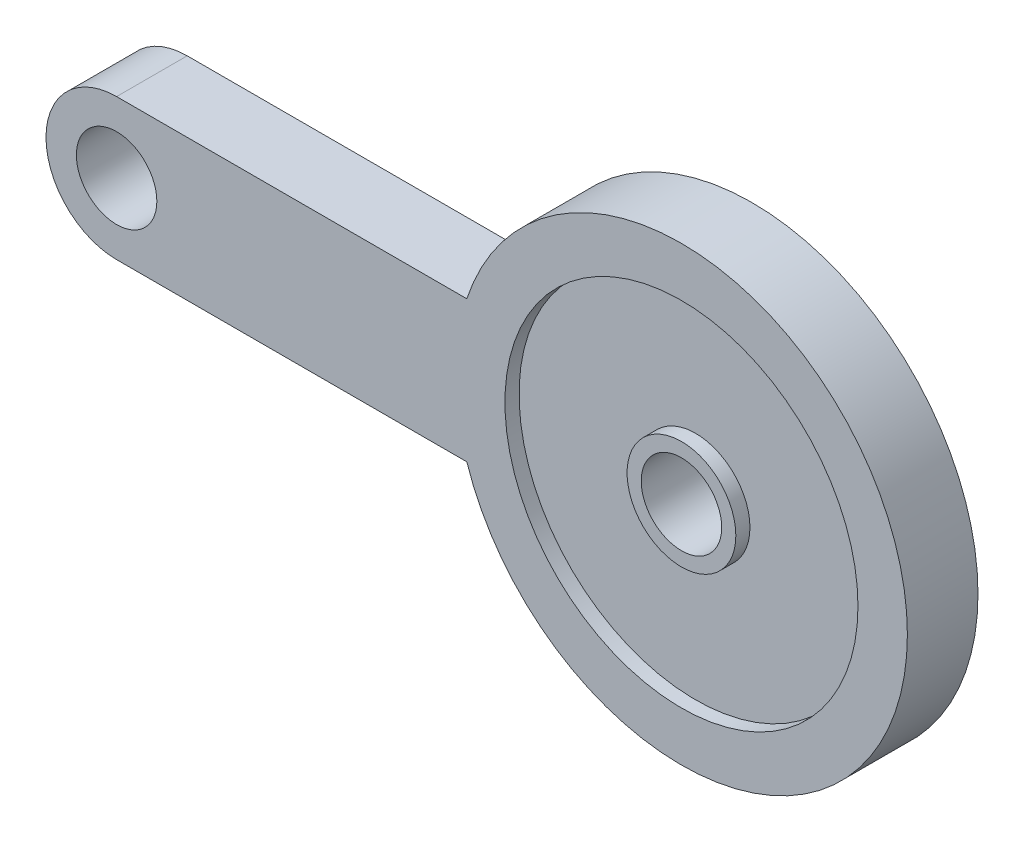
ISO-10303-21;
HEADER;
FILE_DESCRIPTION(('STEP AP214'),'2;1');
FILE_NAME('part.step','',(''),(''),'','','');
FILE_SCHEMA(('AUTOMOTIVE_DESIGN { 1 0 10303 214 1 1 1 1 }'));
ENDSEC;
DATA;
#1=APPLICATION_CONTEXT('core data for automotive mechanical design processes');
#2=APPLICATION_PROTOCOL_DEFINITION('international standard','automotive_design',2000,#1);
#3=PRODUCT_CONTEXT('',#1,'mechanical');
#4=PRODUCT('Part','Part','',(#3));
#5=PRODUCT_RELATED_PRODUCT_CATEGORY('part','',(#4));
#6=PRODUCT_DEFINITION_FORMATION('','',#4);
#7=PRODUCT_DEFINITION_CONTEXT('part definition',#1,'design');
#8=PRODUCT_DEFINITION('design','',#6,#7);
#9=PRODUCT_DEFINITION_SHAPE('','',#8);
#10=(LENGTH_UNIT() NAMED_UNIT(*) SI_UNIT(.MILLI.,.METRE.));
#11=(NAMED_UNIT(*) PLANE_ANGLE_UNIT() SI_UNIT($,.RADIAN.));
#12=(NAMED_UNIT(*) SI_UNIT($,.STERADIAN.) SOLID_ANGLE_UNIT());
#13=UNCERTAINTY_MEASURE_WITH_UNIT(LENGTH_MEASURE(1.E-05),#10,'distance_accuracy_value','');
#14=(GEOMETRIC_REPRESENTATION_CONTEXT(3) GLOBAL_UNCERTAINTY_ASSIGNED_CONTEXT((#13)) GLOBAL_UNIT_ASSIGNED_CONTEXT((#10,
#11,#12)) REPRESENTATION_CONTEXT('',''));
#15=CARTESIAN_POINT('',(0.,0.,0.));
#16=DIRECTION('',(0.,0.,1.));
#17=DIRECTION('',(1.,0.,0.));
#18=AXIS2_PLACEMENT_3D('',#15,#16,#17);
#19=CARTESIAN_POINT('',(20.,0.,1.5));
#20=DIRECTION('',(0.,0.,1.));
#21=DIRECTION('',(1.,0.,0.));
#22=AXIS2_PLACEMENT_3D('',#19,#20,#21);
#23=PLANE('',#22);
#24=CARTESIAN_POINT('',(20.,0.,1.5));
#25=DIRECTION('',(0.,0.,1.));
#26=DIRECTION('',(1.,0.,0.));
#27=AXIS2_PLACEMENT_3D('',#24,#25,#26);
#28=CIRCLE('',#27,12.5);
#29=CARTESIAN_POINT('',(32.5,0.,1.5));
#30=VERTEX_POINT('',#29);
#31=EDGE_CURVE('E85',#30,#30,#28,.T.);
#32=ORIENTED_EDGE('',*,*,#31,.T.);
#33=EDGE_LOOP('',(#32));
#34=FACE_BOUND('',#33,.T.);
#35=CARTESIAN_POINT('',(20.,0.,1.5));
#36=DIRECTION('',(0.,0.,1.));
#37=DIRECTION('',(1.,0.,0.));
#38=AXIS2_PLACEMENT_3D('',#35,#36,#37);
#39=CIRCLE('',#38,3.85);
#40=CARTESIAN_POINT('',(23.85,0.,1.5));
#41=VERTEX_POINT('',#40);
#42=EDGE_CURVE('E130',#41,#41,#39,.F.);
#43=ORIENTED_EDGE('',*,*,#42,.T.);
#44=EDGE_LOOP('',(#43));
#45=FACE_BOUND('',#44,.T.);
#46=ADVANCED_FACE('F39',(#34,#45),#23,.T.);
#47=CARTESIAN_POINT('',(20.,0.,-1.5));
#48=DIRECTION('',(0.,0.,1.));
#49=DIRECTION('',(1.,0.,0.));
#50=AXIS2_PLACEMENT_3D('',#47,#48,#49);
#51=PLANE('',#50);
#52=CARTESIAN_POINT('',(20.,0.,-1.5));
#53=DIRECTION('',(0.,0.,1.));
#54=DIRECTION('',(1.,0.,0.));
#55=AXIS2_PLACEMENT_3D('',#52,#53,#54);
#56=CIRCLE('',#55,12.5);
#57=CARTESIAN_POINT('',(32.5,0.,-1.5));
#58=VERTEX_POINT('',#57);
#59=EDGE_CURVE('E124',#58,#58,#56,.T.);
#60=ORIENTED_EDGE('',*,*,#59,.F.);
#61=EDGE_LOOP('',(#60));
#62=FACE_BOUND('',#61,.T.);
#63=CARTESIAN_POINT('',(20.,0.,-1.5));
#64=DIRECTION('',(0.,0.,1.));
#65=DIRECTION('',(1.,0.,0.));
#66=AXIS2_PLACEMENT_3D('',#63,#64,#65);
#67=CIRCLE('',#66,3.85);
#68=CARTESIAN_POINT('',(23.85,0.,-1.5));
#69=VERTEX_POINT('',#68);
#70=EDGE_CURVE('E11',#69,#69,#67,.F.);
#71=ORIENTED_EDGE('',*,*,#70,.F.);
#72=EDGE_LOOP('',(#71));
#73=FACE_BOUND('',#72,.T.);
#74=ADVANCED_FACE('F159',(#62,#73),#51,.F.);
#75=CARTESIAN_POINT('',(-20.,-5.,2.5));
#76=DIRECTION('',(0.,1.,0.));
#77=DIRECTION('',(-1.,0.,0.));
#78=AXIS2_PLACEMENT_3D('',#75,#76,#77);
#79=PLANE('',#78);
#80=DIRECTION('',(0.,0.,-1.));
#81=VECTOR('',#80,1.);
#82=CARTESIAN_POINT('',(4.80131584642933,-5.,2.5));
#83=LINE('',#82,#81);
#84=CARTESIAN_POINT('',(4.80131584642933,-5.,2.5));
#85=VERTEX_POINT('',#84);
#86=CARTESIAN_POINT('',(4.80131584642933,-5.,-2.5));
#87=VERTEX_POINT('',#86);
#88=EDGE_CURVE('E54',#85,#87,#83,.T.);
#89=ORIENTED_EDGE('',*,*,#88,.F.);
#90=DIRECTION('',(1.,0.,0.));
#91=VECTOR('',#90,1.);
#92=CARTESIAN_POINT('',(-20.,-5.,2.5));
#93=LINE('',#92,#91);
#94=CARTESIAN_POINT('',(-20.,-5.,2.5));
#95=VERTEX_POINT('',#94);
#96=EDGE_CURVE('E110',#95,#85,#93,.T.);
#97=ORIENTED_EDGE('',*,*,#96,.F.);
#98=DIRECTION('',(0.,0.,-1.));
#99=VECTOR('',#98,1.);
#100=CARTESIAN_POINT('',(-20.,-5.,2.5));
#101=LINE('',#100,#99);
#102=CARTESIAN_POINT('',(-20.,-5.,-2.5));
#103=VERTEX_POINT('',#102);
#104=EDGE_CURVE('E101',#95,#103,#101,.T.);
#105=ORIENTED_EDGE('',*,*,#104,.T.);
#106=DIRECTION('',(1.,0.,0.));
#107=VECTOR('',#106,1.);
#108=CARTESIAN_POINT('',(-20.,-5.,-2.5));
#109=LINE('',#108,#107);
#110=EDGE_CURVE('E59',#103,#87,#109,.T.);
#111=ORIENTED_EDGE('',*,*,#110,.T.);
#112=EDGE_LOOP('',(#89,#97,#105,#111));
#113=FACE_BOUND('',#112,.T.);
#114=ADVANCED_FACE('F161',(#113),#79,.F.);
#115=CARTESIAN_POINT('',(-20.,5.,2.5));
#116=DIRECTION('',(0.,-1.,0.));
#117=DIRECTION('',(1.,0.,0.));
#118=AXIS2_PLACEMENT_3D('',#115,#116,#117);
#119=PLANE('',#118);
#120=DIRECTION('',(0.,0.,-1.));
#121=VECTOR('',#120,1.);
#122=CARTESIAN_POINT('',(4.80131584642933,5.,2.5));
#123=LINE('',#122,#121);
#124=CARTESIAN_POINT('',(4.80131584642933,5.,-2.5));
#125=VERTEX_POINT('',#124);
#126=CARTESIAN_POINT('',(4.80131584642933,5.,2.5));
#127=VERTEX_POINT('',#126);
#128=EDGE_CURVE('E47',#125,#127,#123,.F.);
#129=ORIENTED_EDGE('',*,*,#128,.F.);
#130=DIRECTION('',(-1.,0.,0.));
#131=VECTOR('',#130,1.);
#132=CARTESIAN_POINT('',(-20.,5.,-2.5));
#133=LINE('',#132,#131);
#134=CARTESIAN_POINT('',(-20.,5.,-2.5));
#135=VERTEX_POINT('',#134);
#136=EDGE_CURVE('E88',#125,#135,#133,.T.);
#137=ORIENTED_EDGE('',*,*,#136,.T.);
#138=DIRECTION('',(0.,0.,-1.));
#139=VECTOR('',#138,1.);
#140=CARTESIAN_POINT('',(-20.,5.,2.5));
#141=LINE('',#140,#139);
#142=CARTESIAN_POINT('',(-20.,5.,2.5));
#143=VERTEX_POINT('',#142);
#144=EDGE_CURVE('E102',#143,#135,#141,.T.);
#145=ORIENTED_EDGE('',*,*,#144,.F.);
#146=DIRECTION('',(-1.,0.,0.));
#147=VECTOR('',#146,1.);
#148=CARTESIAN_POINT('',(-20.,5.,2.5));
#149=LINE('',#148,#147);
#150=EDGE_CURVE('E100',#127,#143,#149,.T.);
#151=ORIENTED_EDGE('',*,*,#150,.F.);
#152=EDGE_LOOP('',(#129,#137,#145,#151));
#153=FACE_BOUND('',#152,.T.);
#154=ADVANCED_FACE('F99',(#153),#119,.F.);
#155=CARTESIAN_POINT('',(-20.,0.,2.5));
#156=DIRECTION('',(0.,0.,1.));
#157=DIRECTION('',(1.,0.,0.));
#158=AXIS2_PLACEMENT_3D('',#155,#156,#157);
#159=PLANE('',#158);
#160=CARTESIAN_POINT('',(20.,0.,2.5));
#161=DIRECTION('',(0.,0.,1.));
#162=DIRECTION('',(1.,0.,0.));
#163=AXIS2_PLACEMENT_3D('',#160,#161,#162);
#164=CIRCLE('',#163,16.);
#165=EDGE_CURVE('E84',#85,#127,#164,.T.);
#166=ORIENTED_EDGE('',*,*,#165,.T.);
#167=ORIENTED_EDGE('',*,*,#150,.T.);
#168=CARTESIAN_POINT('',(-20.,0.,2.5));
#169=DIRECTION('',(0.,0.,1.));
#170=DIRECTION('',(1.,0.,0.));
#171=AXIS2_PLACEMENT_3D('',#168,#169,#170);
#172=CIRCLE('',#171,5.);
#173=EDGE_CURVE('E96',#143,#95,#172,.T.);
#174=ORIENTED_EDGE('',*,*,#173,.T.);
#175=ORIENTED_EDGE('',*,*,#96,.T.);
#176=EDGE_LOOP('',(#166,#167,#174,#175));
#177=FACE_BOUND('',#176,.T.);
#178=CARTESIAN_POINT('',(20.,0.,2.5));
#179=DIRECTION('',(0.,0.,1.));
#180=DIRECTION('',(1.,0.,0.));
#181=AXIS2_PLACEMENT_3D('',#178,#179,#180);
#182=CIRCLE('',#181,12.5);
#183=CARTESIAN_POINT('',(32.5,0.,2.5));
#184=VERTEX_POINT('',#183);
#185=EDGE_CURVE('E121',#184,#184,#182,.T.);
#186=ORIENTED_EDGE('',*,*,#185,.F.);
#187=EDGE_LOOP('',(#186));
#188=FACE_BOUND('',#187,.T.);
#189=CARTESIAN_POINT('',(-20.,0.,2.5));
#190=DIRECTION('',(0.,0.,1.));
#191=DIRECTION('',(1.,0.,0.));
#192=AXIS2_PLACEMENT_3D('',#189,#190,#191);
#193=CIRCLE('',#192,2.85);
#194=CARTESIAN_POINT('',(-17.15,0.,2.5));
#195=VERTEX_POINT('',#194);
#196=EDGE_CURVE('E108',#195,#195,#193,.T.);
#197=ORIENTED_EDGE('',*,*,#196,.F.);
#198=EDGE_LOOP('',(#197));
#199=FACE_BOUND('',#198,.T.);
#200=ADVANCED_FACE('F190',(#177,#188,#199),#159,.T.);
#201=CARTESIAN_POINT('',(-20.,0.,-2.5));
#202=DIRECTION('',(0.,0.,1.));
#203=DIRECTION('',(1.,0.,0.));
#204=AXIS2_PLACEMENT_3D('',#201,#202,#203);
#205=PLANE('',#204);
#206=CARTESIAN_POINT('',(20.,0.,-2.5));
#207=DIRECTION('',(0.,0.,1.));
#208=DIRECTION('',(1.,0.,0.));
#209=AXIS2_PLACEMENT_3D('',#206,#207,#208);
#210=CIRCLE('',#209,12.5);
#211=CARTESIAN_POINT('',(32.5,0.,-2.5));
#212=VERTEX_POINT('',#211);
#213=EDGE_CURVE('E127',#212,#212,#210,.T.);
#214=ORIENTED_EDGE('',*,*,#213,.T.);
#215=EDGE_LOOP('',(#214));
#216=FACE_BOUND('',#215,.T.);
#217=ORIENTED_EDGE('',*,*,#136,.F.);
#218=CARTESIAN_POINT('',(20.,0.,-2.5));
#219=DIRECTION('',(0.,0.,1.));
#220=DIRECTION('',(1.,0.,0.));
#221=AXIS2_PLACEMENT_3D('',#218,#219,#220);
#222=CIRCLE('',#221,16.);
#223=EDGE_CURVE('E78',#87,#125,#222,.T.);
#224=ORIENTED_EDGE('',*,*,#223,.F.);
#225=ORIENTED_EDGE('',*,*,#110,.F.);
#226=CARTESIAN_POINT('',(-20.,0.,-2.5));
#227=DIRECTION('',(0.,0.,1.));
#228=DIRECTION('',(1.,0.,0.));
#229=AXIS2_PLACEMENT_3D('',#226,#227,#228);
#230=CIRCLE('',#229,5.);
#231=EDGE_CURVE('E92',#135,#103,#230,.T.);
#232=ORIENTED_EDGE('',*,*,#231,.F.);
#233=EDGE_LOOP('',(#217,#224,#225,#232));
#234=FACE_BOUND('',#233,.T.);
#235=CARTESIAN_POINT('',(-20.,0.,-2.5));
#236=DIRECTION('',(0.,0.,1.));
#237=DIRECTION('',(1.,0.,0.));
#238=AXIS2_PLACEMENT_3D('',#235,#236,#237);
#239=CIRCLE('',#238,2.85);
#240=CARTESIAN_POINT('',(-17.15,0.,-2.5));
#241=VERTEX_POINT('',#240);
#242=EDGE_CURVE('E114',#241,#241,#239,.T.);
#243=ORIENTED_EDGE('',*,*,#242,.T.);
#244=EDGE_LOOP('',(#243));
#245=FACE_BOUND('',#244,.T.);
#246=ADVANCED_FACE('F89',(#216,#234,#245),#205,.F.);
#247=CARTESIAN_POINT('',(-20.,0.,2.5));
#248=DIRECTION('',(0.,0.,-1.));
#249=DIRECTION('',(-1.,0.,0.));
#250=AXIS2_PLACEMENT_3D('',#247,#248,#249);
#251=CYLINDRICAL_SURFACE('',#250,5.);
#252=ORIENTED_EDGE('',*,*,#231,.T.);
#253=ORIENTED_EDGE('',*,*,#104,.F.);
#254=ORIENTED_EDGE('',*,*,#173,.F.);
#255=ORIENTED_EDGE('',*,*,#144,.T.);
#256=EDGE_LOOP('',(#252,#253,#254,#255));
#257=FACE_BOUND('',#256,.T.);
#258=ADVANCED_FACE('F41',(#257),#251,.T.);
#259=CARTESIAN_POINT('',(-20.,0.,2.5));
#260=DIRECTION('',(0.,0.,-1.));
#261=DIRECTION('',(-1.,0.,0.));
#262=AXIS2_PLACEMENT_3D('',#259,#260,#261);
#263=CYLINDRICAL_SURFACE('',#262,2.85);
#264=ORIENTED_EDGE('',*,*,#196,.T.);
#265=EDGE_LOOP('',(#264));
#266=FACE_BOUND('',#265,.T.);
#267=ORIENTED_EDGE('',*,*,#242,.F.);
#268=EDGE_LOOP('',(#267));
#269=FACE_BOUND('',#268,.T.);
#270=ADVANCED_FACE('F182',(#266,#269),#263,.F.);
#271=CARTESIAN_POINT('',(20.,0.,2.5));
#272=DIRECTION('',(0.,0.,-1.));
#273=DIRECTION('',(-1.,0.,0.));
#274=AXIS2_PLACEMENT_3D('',#271,#272,#273);
#275=CYLINDRICAL_SURFACE('',#274,16.);
#276=ORIENTED_EDGE('',*,*,#223,.T.);
#277=ORIENTED_EDGE('',*,*,#128,.T.);
#278=ORIENTED_EDGE('',*,*,#165,.F.);
#279=ORIENTED_EDGE('',*,*,#88,.T.);
#280=EDGE_LOOP('',(#276,#277,#278,#279));
#281=FACE_BOUND('',#280,.T.);
#282=ADVANCED_FACE('F80',(#281),#275,.T.);
#283=CARTESIAN_POINT('',(20.,0.,1.5));
#284=DIRECTION('',(0.,0.,1.));
#285=DIRECTION('',(1.,0.,0.));
#286=AXIS2_PLACEMENT_3D('',#283,#284,#285);
#287=CYLINDRICAL_SURFACE('',#286,12.5);
#288=ORIENTED_EDGE('',*,*,#31,.F.);
#289=EDGE_LOOP('',(#288));
#290=FACE_BOUND('',#289,.T.);
#291=ORIENTED_EDGE('',*,*,#185,.T.);
#292=EDGE_LOOP('',(#291));
#293=FACE_BOUND('',#292,.T.);
#294=ADVANCED_FACE('F174',(#290,#293),#287,.F.);
#295=CARTESIAN_POINT('',(20.,0.,-1.5));
#296=DIRECTION('',(0.,0.,-1.));
#297=DIRECTION('',(-1.,0.,0.));
#298=AXIS2_PLACEMENT_3D('',#295,#296,#297);
#299=CYLINDRICAL_SURFACE('',#298,12.5);
#300=ORIENTED_EDGE('',*,*,#59,.T.);
#301=EDGE_LOOP('',(#300));
#302=FACE_BOUND('',#301,.T.);
#303=ORIENTED_EDGE('',*,*,#213,.F.);
#304=EDGE_LOOP('',(#303));
#305=FACE_BOUND('',#304,.T.);
#306=ADVANCED_FACE('F154',(#302,#305),#299,.F.);
#307=CARTESIAN_POINT('',(20.,0.,13.3894444302728));
#308=DIRECTION('',(0.,0.,-1.));
#309=DIRECTION('',(-1.,0.,0.));
#310=AXIS2_PLACEMENT_3D('',#307,#308,#309);
#311=CYLINDRICAL_SURFACE('',#310,3.85);
#312=CARTESIAN_POINT('',(20.,0.,-2.5));
#313=DIRECTION('',(0.,0.,1.));
#314=DIRECTION('',(1.,0.,0.));
#315=AXIS2_PLACEMENT_3D('',#312,#313,#314);
#316=CIRCLE('',#315,3.85);
#317=CARTESIAN_POINT('',(23.85,0.,-2.5));
#318=VERTEX_POINT('',#317);
#319=EDGE_CURVE('E144',#318,#318,#316,.F.);
#320=ORIENTED_EDGE('',*,*,#319,.F.);
#321=EDGE_LOOP('',(#320));
#322=FACE_BOUND('',#321,.T.);
#323=ORIENTED_EDGE('',*,*,#70,.T.);
#324=EDGE_LOOP('',(#323));
#325=FACE_BOUND('',#324,.T.);
#326=ADVANCED_FACE('F151',(#322,#325),#311,.T.);
#327=CARTESIAN_POINT('',(-20.,0.,-2.5));
#328=DIRECTION('',(0.,0.,1.));
#329=DIRECTION('',(1.,0.,0.));
#330=AXIS2_PLACEMENT_3D('',#327,#328,#329);
#331=PLANE('',#330);
#332=ORIENTED_EDGE('',*,*,#319,.T.);
#333=EDGE_LOOP('',(#332));
#334=FACE_BOUND('',#333,.T.);
#335=CARTESIAN_POINT('',(20.,0.,-2.5));
#336=DIRECTION('',(0.,0.,1.));
#337=DIRECTION('',(1.,0.,0.));
#338=AXIS2_PLACEMENT_3D('',#335,#336,#337);
#339=CIRCLE('',#338,2.85);
#340=CARTESIAN_POINT('',(22.85,0.,-2.5));
#341=VERTEX_POINT('',#340);
#342=EDGE_CURVE('E139',#341,#341,#339,.F.);
#343=ORIENTED_EDGE('',*,*,#342,.F.);
#344=EDGE_LOOP('',(#343));
#345=FACE_BOUND('',#344,.T.);
#346=ADVANCED_FACE('F148',(#334,#345),#331,.F.);
#347=CARTESIAN_POINT('',(20.,0.,2.5));
#348=DIRECTION('',(0.,0.,-1.));
#349=DIRECTION('',(-1.,0.,0.));
#350=AXIS2_PLACEMENT_3D('',#347,#348,#349);
#351=CYLINDRICAL_SURFACE('',#350,2.85);
#352=ORIENTED_EDGE('',*,*,#342,.T.);
#353=EDGE_LOOP('',(#352));
#354=FACE_BOUND('',#353,.T.);
#355=CARTESIAN_POINT('',(20.,0.,2.5));
#356=DIRECTION('',(0.,0.,1.));
#357=DIRECTION('',(1.,0.,0.));
#358=AXIS2_PLACEMENT_3D('',#355,#356,#357);
#359=CIRCLE('',#358,2.85);
#360=CARTESIAN_POINT('',(22.85,0.,2.5));
#361=VERTEX_POINT('',#360);
#362=EDGE_CURVE('E136',#361,#361,#359,.T.);
#363=ORIENTED_EDGE('',*,*,#362,.T.);
#364=EDGE_LOOP('',(#363));
#365=FACE_BOUND('',#364,.T.);
#366=ADVANCED_FACE('F183',(#354,#365),#351,.F.);
#367=ORIENTED_EDGE('',*,*,#42,.F.);
#368=EDGE_LOOP('',(#367));
#369=FACE_BOUND('',#368,.T.);
#370=CARTESIAN_POINT('',(20.,0.,2.5));
#371=DIRECTION('',(0.,0.,1.));
#372=DIRECTION('',(1.,0.,0.));
#373=AXIS2_PLACEMENT_3D('',#370,#371,#372);
#374=CIRCLE('',#373,3.85);
#375=CARTESIAN_POINT('',(23.85,0.,2.5));
#376=VERTEX_POINT('',#375);
#377=EDGE_CURVE('E135',#376,#376,#374,.T.);
#378=ORIENTED_EDGE('',*,*,#377,.F.);
#379=EDGE_LOOP('',(#378));
#380=FACE_BOUND('',#379,.T.);
#381=ADVANCED_FACE('F156',(#369,#380),#311,.T.);
#382=CARTESIAN_POINT('',(-20.,0.,2.5));
#383=DIRECTION('',(0.,0.,1.));
#384=DIRECTION('',(1.,0.,0.));
#385=AXIS2_PLACEMENT_3D('',#382,#383,#384);
#386=PLANE('',#385);
#387=ORIENTED_EDGE('',*,*,#362,.F.);
#388=EDGE_LOOP('',(#387));
#389=FACE_BOUND('',#388,.T.);
#390=ORIENTED_EDGE('',*,*,#377,.T.);
#391=EDGE_LOOP('',(#390));
#392=FACE_BOUND('',#391,.T.);
#393=ADVANCED_FACE('F254',(#389,#392),#386,.T.);
#394=CLOSED_SHELL('',(#46,#74,#114,#154,#200,#246,#258,#270,#282,#294,#306,#326,#346,#366,#381,#393));
#395=MANIFOLD_SOLID_BREP('B2',#394);
#396=ADVANCED_BREP_SHAPE_REPRESENTATION('',(#18,#395),#14);
#397=SHAPE_DEFINITION_REPRESENTATION(#9,#396);
ENDSEC;
END-ISO-10303-21;
